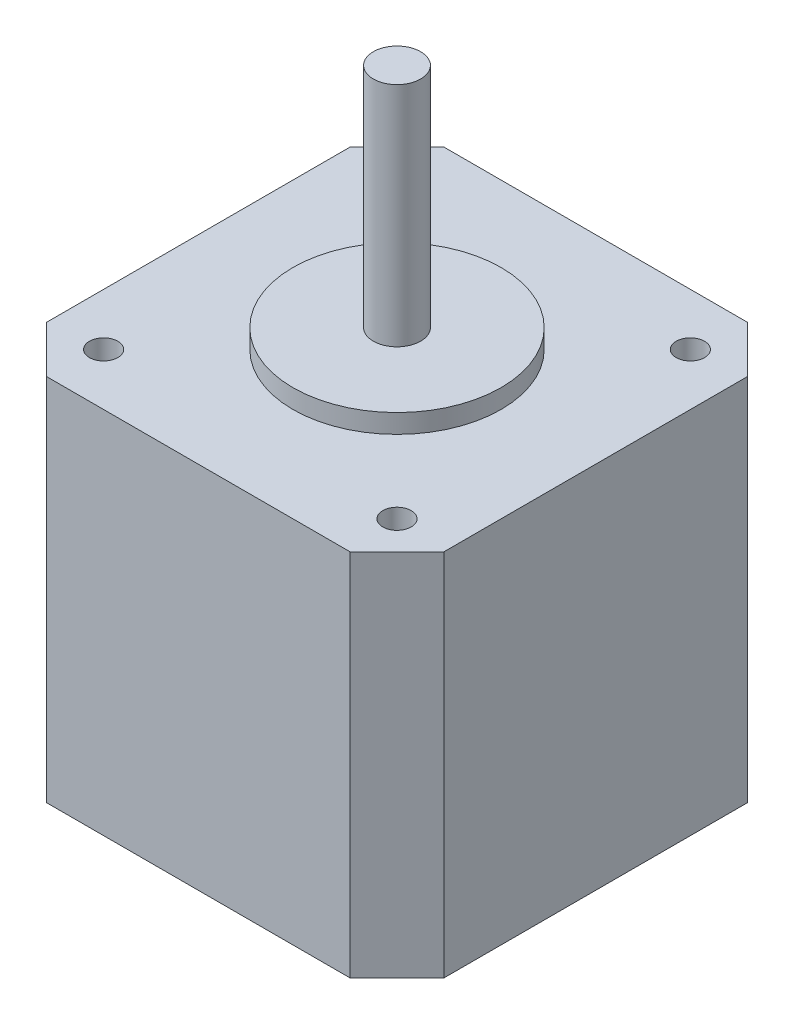
ISO-10303-21;
HEADER;
FILE_DESCRIPTION(('STEP AP214'),'2;1');
FILE_NAME('part.step','',(''),(''),'','','');
FILE_SCHEMA(('AUTOMOTIVE_DESIGN { 1 0 10303 214 1 1 1 1 }'));
ENDSEC;
DATA;
#1=APPLICATION_CONTEXT('core data for automotive mechanical design processes');
#2=APPLICATION_PROTOCOL_DEFINITION('international standard','automotive_design',2000,#1);
#3=PRODUCT_CONTEXT('',#1,'mechanical');
#4=PRODUCT('Part','Part','',(#3));
#5=PRODUCT_RELATED_PRODUCT_CATEGORY('part','',(#4));
#6=PRODUCT_DEFINITION_FORMATION('','',#4);
#7=PRODUCT_DEFINITION_CONTEXT('part definition',#1,'design');
#8=PRODUCT_DEFINITION('design','',#6,#7);
#9=PRODUCT_DEFINITION_SHAPE('','',#8);
#10=(LENGTH_UNIT() NAMED_UNIT(*) SI_UNIT(.MILLI.,.METRE.));
#11=(NAMED_UNIT(*) PLANE_ANGLE_UNIT() SI_UNIT($,.RADIAN.));
#12=(NAMED_UNIT(*) SI_UNIT($,.STERADIAN.) SOLID_ANGLE_UNIT());
#13=UNCERTAINTY_MEASURE_WITH_UNIT(LENGTH_MEASURE(1.E-05),#10,'distance_accuracy_value','');
#14=(GEOMETRIC_REPRESENTATION_CONTEXT(3) GLOBAL_UNCERTAINTY_ASSIGNED_CONTEXT((#13)) GLOBAL_UNIT_ASSIGNED_CONTEXT((#10,
#11,#12)) REPRESENTATION_CONTEXT('',''));
#15=CARTESIAN_POINT('',(0.,0.,0.));
#16=DIRECTION('',(0.,0.,1.));
#17=DIRECTION('',(1.,0.,0.));
#18=AXIS2_PLACEMENT_3D('',#15,#16,#17);
#19=CARTESIAN_POINT('',(0.,39.,0.));
#20=DIRECTION('',(1.,0.,0.));
#21=DIRECTION('',(0.,0.,-1.));
#22=AXIS2_PLACEMENT_3D('',#19,#20,#21);
#23=PLANE('',#22);
#24=DIRECTION('',(0.,0.,1.));
#25=VECTOR('',#24,1.);
#26=CARTESIAN_POINT('',(0.,39.,0.));
#27=LINE('',#26,#25);
#28=CARTESIAN_POINT('',(0.,39.,-37.0502525316942));
#29=VERTEX_POINT('',#28);
#30=CARTESIAN_POINT('',(0.,39.,-4.94974746830583));
#31=VERTEX_POINT('',#30);
#32=EDGE_CURVE('E121',#29,#31,#27,.T.);
#33=ORIENTED_EDGE('',*,*,#32,.F.);
#34=DIRECTION('',(0.,1.,0.));
#35=VECTOR('',#34,1.);
#36=CARTESIAN_POINT('',(0.,0.,-37.0502525316942));
#37=LINE('',#36,#35);
#38=CARTESIAN_POINT('',(0.,0.,-37.0502525316942));
#39=VERTEX_POINT('',#38);
#40=EDGE_CURVE('E178',#39,#29,#37,.T.);
#41=ORIENTED_EDGE('',*,*,#40,.F.);
#42=DIRECTION('',(0.,0.,1.));
#43=VECTOR('',#42,1.);
#44=CARTESIAN_POINT('',(0.,0.,0.));
#45=LINE('',#44,#43);
#46=CARTESIAN_POINT('',(0.,0.,-4.94974746830583));
#47=VERTEX_POINT('',#46);
#48=EDGE_CURVE('E122',#39,#47,#45,.T.);
#49=ORIENTED_EDGE('',*,*,#48,.T.);
#50=DIRECTION('',(0.,1.,0.));
#51=VECTOR('',#50,1.);
#52=CARTESIAN_POINT('',(0.,0.,-4.94974746830583));
#53=LINE('',#52,#51);
#54=EDGE_CURVE('E166',#47,#31,#53,.T.);
#55=ORIENTED_EDGE('',*,*,#54,.T.);
#56=EDGE_LOOP('',(#33,#41,#49,#55));
#57=FACE_BOUND('',#56,.T.);
#58=ADVANCED_FACE('F33',(#57),#23,.F.);
#59=CARTESIAN_POINT('',(0.,39.,0.));
#60=DIRECTION('',(0.,0.,-1.));
#61=DIRECTION('',(-1.,0.,0.));
#62=AXIS2_PLACEMENT_3D('',#59,#60,#61);
#63=PLANE('',#62);
#64=DIRECTION('',(1.,0.,0.));
#65=VECTOR('',#64,1.);
#66=CARTESIAN_POINT('',(0.,0.,0.));
#67=LINE('',#66,#65);
#68=CARTESIAN_POINT('',(4.94974746830583,0.,0.));
#69=VERTEX_POINT('',#68);
#70=CARTESIAN_POINT('',(37.0502525316942,0.,0.));
#71=VERTEX_POINT('',#70);
#72=EDGE_CURVE('E119',#69,#71,#67,.T.);
#73=ORIENTED_EDGE('',*,*,#72,.T.);
#74=DIRECTION('',(0.,1.,0.));
#75=VECTOR('',#74,1.);
#76=CARTESIAN_POINT('',(37.0502525316942,0.,0.));
#77=LINE('',#76,#75);
#78=CARTESIAN_POINT('',(37.0502525316942,39.,0.));
#79=VERTEX_POINT('',#78);
#80=EDGE_CURVE('E49',#71,#79,#77,.T.);
#81=ORIENTED_EDGE('',*,*,#80,.T.);
#82=DIRECTION('',(1.,0.,0.));
#83=VECTOR('',#82,1.);
#84=CARTESIAN_POINT('',(0.,39.,0.));
#85=LINE('',#84,#83);
#86=CARTESIAN_POINT('',(4.94974746830583,39.,0.));
#87=VERTEX_POINT('',#86);
#88=EDGE_CURVE('E132',#87,#79,#85,.T.);
#89=ORIENTED_EDGE('',*,*,#88,.F.);
#90=DIRECTION('',(0.,1.,0.));
#91=VECTOR('',#90,1.);
#92=CARTESIAN_POINT('',(4.94974746830583,0.,0.));
#93=LINE('',#92,#91);
#94=EDGE_CURVE('E169',#69,#87,#93,.T.);
#95=ORIENTED_EDGE('',*,*,#94,.F.);
#96=EDGE_LOOP('',(#73,#81,#89,#95));
#97=FACE_BOUND('',#96,.T.);
#98=ADVANCED_FACE('F197',(#97),#63,.F.);
#99=CARTESIAN_POINT('',(42.,39.,0.));
#100=DIRECTION('',(-1.,0.,0.));
#101=DIRECTION('',(0.,0.,1.));
#102=AXIS2_PLACEMENT_3D('',#99,#100,#101);
#103=PLANE('',#102);
#104=DIRECTION('',(0.,0.,-1.));
#105=VECTOR('',#104,1.);
#106=CARTESIAN_POINT('',(42.,0.,0.));
#107=LINE('',#106,#105);
#108=CARTESIAN_POINT('',(42.,0.,-4.94974746830583));
#109=VERTEX_POINT('',#108);
#110=CARTESIAN_POINT('',(42.,0.,-37.0502525316942));
#111=VERTEX_POINT('',#110);
#112=EDGE_CURVE('E111',#109,#111,#107,.T.);
#113=ORIENTED_EDGE('',*,*,#112,.T.);
#114=DIRECTION('',(0.,1.,0.));
#115=VECTOR('',#114,1.);
#116=CARTESIAN_POINT('',(42.,0.,-37.0502525316942));
#117=LINE('',#116,#115);
#118=CARTESIAN_POINT('',(42.,39.,-37.0502525316942));
#119=VERTEX_POINT('',#118);
#120=EDGE_CURVE('E57',#111,#119,#117,.T.);
#121=ORIENTED_EDGE('',*,*,#120,.T.);
#122=DIRECTION('',(0.,0.,-1.));
#123=VECTOR('',#122,1.);
#124=CARTESIAN_POINT('',(42.,39.,0.));
#125=LINE('',#124,#123);
#126=CARTESIAN_POINT('',(42.,39.,-4.94974746830583));
#127=VERTEX_POINT('',#126);
#128=EDGE_CURVE('E113',#127,#119,#125,.T.);
#129=ORIENTED_EDGE('',*,*,#128,.F.);
#130=DIRECTION('',(0.,1.,0.));
#131=VECTOR('',#130,1.);
#132=CARTESIAN_POINT('',(42.,0.,-4.94974746830583));
#133=LINE('',#132,#131);
#134=EDGE_CURVE('E99',#109,#127,#133,.T.);
#135=ORIENTED_EDGE('',*,*,#134,.F.);
#136=EDGE_LOOP('',(#113,#121,#129,#135));
#137=FACE_BOUND('',#136,.T.);
#138=ADVANCED_FACE('F110',(#137),#103,.F.);
#139=CARTESIAN_POINT('',(0.,39.,-42.));
#140=DIRECTION('',(0.,0.,1.));
#141=DIRECTION('',(1.,0.,0.));
#142=AXIS2_PLACEMENT_3D('',#139,#140,#141);
#143=PLANE('',#142);
#144=DIRECTION('',(-1.,0.,0.));
#145=VECTOR('',#144,1.);
#146=CARTESIAN_POINT('',(0.,0.,-42.));
#147=LINE('',#146,#145);
#148=CARTESIAN_POINT('',(37.0502525316942,0.,-42.));
#149=VERTEX_POINT('',#148);
#150=CARTESIAN_POINT('',(4.94974746830582,0.,-42.));
#151=VERTEX_POINT('',#150);
#152=EDGE_CURVE('E36',#149,#151,#147,.T.);
#153=ORIENTED_EDGE('',*,*,#152,.T.);
#154=DIRECTION('',(0.,1.,0.));
#155=VECTOR('',#154,1.);
#156=CARTESIAN_POINT('',(4.94974746830583,0.,-42.));
#157=LINE('',#156,#155);
#158=CARTESIAN_POINT('',(4.94974746830583,39.,-42.));
#159=VERTEX_POINT('',#158);
#160=EDGE_CURVE('E180',#151,#159,#157,.T.);
#161=ORIENTED_EDGE('',*,*,#160,.T.);
#162=DIRECTION('',(-1.,0.,0.));
#163=VECTOR('',#162,1.);
#164=CARTESIAN_POINT('',(0.,39.,-42.));
#165=LINE('',#164,#163);
#166=CARTESIAN_POINT('',(37.0502525316942,39.,-42.));
#167=VERTEX_POINT('',#166);
#168=EDGE_CURVE('E128',#167,#159,#165,.T.);
#169=ORIENTED_EDGE('',*,*,#168,.F.);
#170=DIRECTION('',(0.,1.,0.));
#171=VECTOR('',#170,1.);
#172=CARTESIAN_POINT('',(37.0502525316942,0.,-42.));
#173=LINE('',#172,#171);
#174=EDGE_CURVE('E188',#149,#167,#173,.T.);
#175=ORIENTED_EDGE('',*,*,#174,.F.);
#176=EDGE_LOOP('',(#153,#161,#169,#175));
#177=FACE_BOUND('',#176,.T.);
#178=ADVANCED_FACE('F211',(#177),#143,.F.);
#179=CARTESIAN_POINT('',(0.,39.,0.));
#180=DIRECTION('',(0.,-1.,0.));
#181=DIRECTION('',(0.,0.,-1.));
#182=AXIS2_PLACEMENT_3D('',#179,#180,#181);
#183=PLANE('',#182);
#184=CARTESIAN_POINT('',(36.5,39.,-36.5));
#185=DIRECTION('',(0.,1.,0.));
#186=DIRECTION('',(0.,0.,-1.));
#187=AXIS2_PLACEMENT_3D('',#184,#185,#186);
#188=CIRCLE('',#187,1.5);
#189=CARTESIAN_POINT('',(36.5,39.,-38.));
#190=VERTEX_POINT('',#189);
#191=EDGE_CURVE('E158',#190,#190,#188,.T.);
#192=ORIENTED_EDGE('',*,*,#191,.F.);
#193=EDGE_LOOP('',(#192));
#194=FACE_BOUND('',#193,.T.);
#195=CARTESIAN_POINT('',(5.49999999999998,39.,-5.50000000000004));
#196=DIRECTION('',(0.,1.,0.));
#197=DIRECTION('',(0.,0.,-1.));
#198=AXIS2_PLACEMENT_3D('',#195,#196,#197);
#199=CIRCLE('',#198,1.5);
#200=CARTESIAN_POINT('',(5.49999999999998,39.,-7.00000000000005));
#201=VERTEX_POINT('',#200);
#202=EDGE_CURVE('E151',#201,#201,#199,.T.);
#203=ORIENTED_EDGE('',*,*,#202,.F.);
#204=EDGE_LOOP('',(#203));
#205=FACE_BOUND('',#204,.T.);
#206=CARTESIAN_POINT('',(5.49999999999999,39.,-36.5));
#207=DIRECTION('',(0.,1.,0.));
#208=DIRECTION('',(0.,0.,1.));
#209=AXIS2_PLACEMENT_3D('',#206,#207,#208);
#210=CIRCLE('',#209,1.50000000000001);
#211=CARTESIAN_POINT('',(5.49999999999999,39.,-35.));
#212=VERTEX_POINT('',#211);
#213=EDGE_CURVE('E163',#212,#212,#210,.T.);
#214=ORIENTED_EDGE('',*,*,#213,.F.);
#215=EDGE_LOOP('',(#214));
#216=FACE_BOUND('',#215,.T.);
#217=CARTESIAN_POINT('',(36.5,39.,-5.5));
#218=DIRECTION('',(0.,1.,0.));
#219=DIRECTION('',(0.,0.,1.));
#220=AXIS2_PLACEMENT_3D('',#217,#218,#219);
#221=CIRCLE('',#220,1.5);
#222=CARTESIAN_POINT('',(36.5,39.,-4.));
#223=VERTEX_POINT('',#222);
#224=EDGE_CURVE('E145',#223,#223,#221,.T.);
#225=ORIENTED_EDGE('',*,*,#224,.F.);
#226=EDGE_LOOP('',(#225));
#227=FACE_BOUND('',#226,.T.);
#228=CARTESIAN_POINT('',(21.,39.,-21.));
#229=DIRECTION('',(0.,1.,0.));
#230=DIRECTION('',(0.,0.,1.));
#231=AXIS2_PLACEMENT_3D('',#228,#229,#230);
#232=CIRCLE('',#231,11.);
#233=CARTESIAN_POINT('',(21.,39.,-10.));
#234=VERTEX_POINT('',#233);
#235=EDGE_CURVE('E41',#234,#234,#232,.T.);
#236=ORIENTED_EDGE('',*,*,#235,.F.);
#237=EDGE_LOOP('',(#236));
#238=FACE_BOUND('',#237,.T.);
#239=ORIENTED_EDGE('',*,*,#168,.T.);
#240=DIRECTION('',(0.707106781186548,0.,-0.707106781186547));
#241=VECTOR('',#240,1.);
#242=CARTESIAN_POINT('',(0.,39.,-37.0502525316942));
#243=LINE('',#242,#241);
#244=EDGE_CURVE('E185',#29,#159,#243,.T.);
#245=ORIENTED_EDGE('',*,*,#244,.F.);
#246=ORIENTED_EDGE('',*,*,#32,.T.);
#247=DIRECTION('',(-0.707106781186548,0.,-0.707106781186548));
#248=VECTOR('',#247,1.);
#249=CARTESIAN_POINT('',(0.,39.,-4.94974746830583));
#250=LINE('',#249,#248);
#251=EDGE_CURVE('E174',#87,#31,#250,.T.);
#252=ORIENTED_EDGE('',*,*,#251,.F.);
#253=ORIENTED_EDGE('',*,*,#88,.T.);
#254=DIRECTION('',(-0.707106781186547,0.,0.707106781186548));
#255=VECTOR('',#254,1.);
#256=CARTESIAN_POINT('',(37.0502525316942,39.,0.));
#257=LINE('',#256,#255);
#258=EDGE_CURVE('E105',#127,#79,#257,.T.);
#259=ORIENTED_EDGE('',*,*,#258,.F.);
#260=ORIENTED_EDGE('',*,*,#128,.T.);
#261=DIRECTION('',(0.707106781186547,0.,0.707106781186547));
#262=VECTOR('',#261,1.);
#263=CARTESIAN_POINT('',(37.0502525316942,39.,-42.));
#264=LINE('',#263,#262);
#265=EDGE_CURVE('E184',#167,#119,#264,.T.);
#266=ORIENTED_EDGE('',*,*,#265,.F.);
#267=EDGE_LOOP('',(#239,#245,#246,#252,#253,#259,#260,#266));
#268=FACE_BOUND('',#267,.T.);
#269=ADVANCED_FACE('F200',(#194,#205,#216,#227,#238,#268),#183,.F.);
#270=CARTESIAN_POINT('',(0.,0.,0.));
#271=DIRECTION('',(0.,-1.,0.));
#272=DIRECTION('',(0.,0.,-1.));
#273=AXIS2_PLACEMENT_3D('',#270,#271,#272);
#274=PLANE('',#273);
#275=DIRECTION('',(0.707106781186548,0.,-0.707106781186547));
#276=VECTOR('',#275,1.);
#277=CARTESIAN_POINT('',(0.,0.,-37.0502525316942));
#278=LINE('',#277,#276);
#279=EDGE_CURVE('E181',#39,#151,#278,.T.);
#280=ORIENTED_EDGE('',*,*,#279,.T.);
#281=ORIENTED_EDGE('',*,*,#152,.F.);
#282=DIRECTION('',(0.707106781186547,0.,0.707106781186547));
#283=VECTOR('',#282,1.);
#284=CARTESIAN_POINT('',(37.0502525316942,0.,-42.));
#285=LINE('',#284,#283);
#286=EDGE_CURVE('E118',#149,#111,#285,.T.);
#287=ORIENTED_EDGE('',*,*,#286,.T.);
#288=ORIENTED_EDGE('',*,*,#112,.F.);
#289=DIRECTION('',(-0.707106781186547,0.,0.707106781186548));
#290=VECTOR('',#289,1.);
#291=CARTESIAN_POINT('',(37.0502525316942,0.,0.));
#292=LINE('',#291,#290);
#293=EDGE_CURVE('E96',#109,#71,#292,.T.);
#294=ORIENTED_EDGE('',*,*,#293,.T.);
#295=ORIENTED_EDGE('',*,*,#72,.F.);
#296=DIRECTION('',(-0.707106781186548,0.,-0.707106781186548));
#297=VECTOR('',#296,1.);
#298=CARTESIAN_POINT('',(0.,0.,-4.94974746830583));
#299=LINE('',#298,#297);
#300=EDGE_CURVE('E171',#69,#47,#299,.T.);
#301=ORIENTED_EDGE('',*,*,#300,.T.);
#302=ORIENTED_EDGE('',*,*,#48,.F.);
#303=EDGE_LOOP('',(#280,#281,#287,#288,#294,#295,#301,#302));
#304=FACE_BOUND('',#303,.T.);
#305=ADVANCED_FACE('F116',(#304),#274,.T.);
#306=CARTESIAN_POINT('',(21.,41.,-21.));
#307=DIRECTION('',(0.,-1.,0.));
#308=DIRECTION('',(0.,0.,-1.));
#309=AXIS2_PLACEMENT_3D('',#306,#307,#308);
#310=CYLINDRICAL_SURFACE('',#309,11.);
#311=CARTESIAN_POINT('',(21.,41.,-21.));
#312=DIRECTION('',(0.,1.,0.));
#313=DIRECTION('',(0.,0.,1.));
#314=AXIS2_PLACEMENT_3D('',#311,#312,#313);
#315=CIRCLE('',#314,11.);
#316=CARTESIAN_POINT('',(21.,41.,-10.));
#317=VERTEX_POINT('',#316);
#318=EDGE_CURVE('E127',#317,#317,#315,.T.);
#319=ORIENTED_EDGE('',*,*,#318,.F.);
#320=EDGE_LOOP('',(#319));
#321=FACE_BOUND('',#320,.T.);
#322=ORIENTED_EDGE('',*,*,#235,.T.);
#323=EDGE_LOOP('',(#322));
#324=FACE_BOUND('',#323,.T.);
#325=ADVANCED_FACE('F236',(#321,#324),#310,.T.);
#326=CARTESIAN_POINT('',(21.,41.,-21.));
#327=DIRECTION('',(0.,1.,0.));
#328=DIRECTION('',(0.,0.,1.));
#329=AXIS2_PLACEMENT_3D('',#326,#327,#328);
#330=PLANE('',#329);
#331=CARTESIAN_POINT('',(21.,41.,-21.));
#332=DIRECTION('',(0.,1.,0.));
#333=DIRECTION('',(0.,0.,1.));
#334=AXIS2_PLACEMENT_3D('',#331,#332,#333);
#335=CIRCLE('',#334,2.5);
#336=CARTESIAN_POINT('',(21.,41.,-18.5));
#337=VERTEX_POINT('',#336);
#338=EDGE_CURVE('E11',#337,#337,#335,.T.);
#339=ORIENTED_EDGE('',*,*,#338,.F.);
#340=EDGE_LOOP('',(#339));
#341=FACE_BOUND('',#340,.T.);
#342=ORIENTED_EDGE('',*,*,#318,.T.);
#343=EDGE_LOOP('',(#342));
#344=FACE_BOUND('',#343,.T.);
#345=ADVANCED_FACE('F242',(#341,#344),#330,.T.);
#346=CARTESIAN_POINT('',(21.,65.,-21.));
#347=DIRECTION('',(0.,-1.,0.));
#348=DIRECTION('',(0.,0.,-1.));
#349=AXIS2_PLACEMENT_3D('',#346,#347,#348);
#350=CYLINDRICAL_SURFACE('',#349,2.5);
#351=CARTESIAN_POINT('',(21.,65.,-21.));
#352=DIRECTION('',(0.,1.,0.));
#353=DIRECTION('',(0.,0.,1.));
#354=AXIS2_PLACEMENT_3D('',#351,#352,#353);
#355=CIRCLE('',#354,2.5);
#356=CARTESIAN_POINT('',(21.,65.,-18.5));
#357=VERTEX_POINT('',#356);
#358=EDGE_CURVE('E140',#357,#357,#355,.T.);
#359=ORIENTED_EDGE('',*,*,#358,.F.);
#360=EDGE_LOOP('',(#359));
#361=FACE_BOUND('',#360,.T.);
#362=ORIENTED_EDGE('',*,*,#338,.T.);
#363=EDGE_LOOP('',(#362));
#364=FACE_BOUND('',#363,.T.);
#365=ADVANCED_FACE('F246',(#361,#364),#350,.T.);
#366=CARTESIAN_POINT('',(21.,65.,-21.));
#367=DIRECTION('',(0.,1.,0.));
#368=DIRECTION('',(0.,0.,1.));
#369=AXIS2_PLACEMENT_3D('',#366,#367,#368);
#370=PLANE('',#369);
#371=ORIENTED_EDGE('',*,*,#358,.T.);
#372=EDGE_LOOP('',(#371));
#373=FACE_BOUND('',#372,.T.);
#374=ADVANCED_FACE('F250',(#373),#370,.T.);
#375=CARTESIAN_POINT('',(36.5,34.5,-5.5));
#376=DIRECTION('',(0.,1.,0.));
#377=DIRECTION('',(0.,0.,1.));
#378=AXIS2_PLACEMENT_3D('',#375,#376,#377);
#379=CYLINDRICAL_SURFACE('',#378,1.5);
#380=CARTESIAN_POINT('',(36.5,34.5,-5.5));
#381=DIRECTION('',(0.,1.,0.));
#382=DIRECTION('',(0.,0.,1.));
#383=AXIS2_PLACEMENT_3D('',#380,#381,#382);
#384=CIRCLE('',#383,1.5);
#385=CARTESIAN_POINT('',(36.5,34.5,-4.));
#386=VERTEX_POINT('',#385);
#387=EDGE_CURVE('E144',#386,#386,#384,.T.);
#388=ORIENTED_EDGE('',*,*,#387,.F.);
#389=EDGE_LOOP('',(#388));
#390=FACE_BOUND('',#389,.T.);
#391=ORIENTED_EDGE('',*,*,#224,.T.);
#392=EDGE_LOOP('',(#391));
#393=FACE_BOUND('',#392,.T.);
#394=ADVANCED_FACE('F254',(#390,#393),#379,.F.);
#395=CARTESIAN_POINT('',(36.5,34.5,-5.5));
#396=DIRECTION('',(0.,1.,0.));
#397=DIRECTION('',(0.,0.,1.));
#398=AXIS2_PLACEMENT_3D('',#395,#396,#397);
#399=PLANE('',#398);
#400=ORIENTED_EDGE('',*,*,#387,.T.);
#401=EDGE_LOOP('',(#400));
#402=FACE_BOUND('',#401,.T.);
#403=ADVANCED_FACE('F258',(#402),#399,.T.);
#404=CARTESIAN_POINT('',(5.49999999999999,34.5,-36.5));
#405=DIRECTION('',(0.,1.,0.));
#406=DIRECTION('',(0.,0.,1.));
#407=AXIS2_PLACEMENT_3D('',#404,#405,#406);
#408=CYLINDRICAL_SURFACE('',#407,1.50000000000001);
#409=CARTESIAN_POINT('',(5.49999999999999,34.5,-36.5));
#410=DIRECTION('',(0.,1.,0.));
#411=DIRECTION('',(0.,0.,1.));
#412=AXIS2_PLACEMENT_3D('',#409,#410,#411);
#413=CIRCLE('',#412,1.50000000000001);
#414=CARTESIAN_POINT('',(5.49999999999999,34.5,-35.));
#415=VERTEX_POINT('',#414);
#416=EDGE_CURVE('E155',#415,#415,#413,.T.);
#417=ORIENTED_EDGE('',*,*,#416,.F.);
#418=EDGE_LOOP('',(#417));
#419=FACE_BOUND('',#418,.T.);
#420=ORIENTED_EDGE('',*,*,#213,.T.);
#421=EDGE_LOOP('',(#420));
#422=FACE_BOUND('',#421,.T.);
#423=ADVANCED_FACE('F262',(#419,#422),#408,.F.);
#424=CARTESIAN_POINT('',(5.49999999999999,34.5,-36.5));
#425=DIRECTION('',(0.,1.,0.));
#426=DIRECTION('',(0.,0.,1.));
#427=AXIS2_PLACEMENT_3D('',#424,#425,#426);
#428=PLANE('',#427);
#429=ORIENTED_EDGE('',*,*,#416,.T.);
#430=EDGE_LOOP('',(#429));
#431=FACE_BOUND('',#430,.T.);
#432=ADVANCED_FACE('F268',(#431),#428,.T.);
#433=CARTESIAN_POINT('',(5.49999999999998,34.5,-5.50000000000004));
#434=DIRECTION('',(0.,1.,0.));
#435=DIRECTION('',(0.,0.,1.));
#436=AXIS2_PLACEMENT_3D('',#433,#434,#435);
#437=CYLINDRICAL_SURFACE('',#436,1.5);
#438=CARTESIAN_POINT('',(5.49999999999998,34.5,-5.50000000000004));
#439=DIRECTION('',(0.,1.,0.));
#440=DIRECTION('',(0.,0.,-1.));
#441=AXIS2_PLACEMENT_3D('',#438,#439,#440);
#442=CIRCLE('',#441,1.5);
#443=CARTESIAN_POINT('',(5.49999999999998,34.5,-7.00000000000005));
#444=VERTEX_POINT('',#443);
#445=EDGE_CURVE('E154',#444,#444,#442,.T.);
#446=ORIENTED_EDGE('',*,*,#445,.F.);
#447=EDGE_LOOP('',(#446));
#448=FACE_BOUND('',#447,.T.);
#449=ORIENTED_EDGE('',*,*,#202,.T.);
#450=EDGE_LOOP('',(#449));
#451=FACE_BOUND('',#450,.T.);
#452=ADVANCED_FACE('F264',(#448,#451),#437,.F.);
#453=CARTESIAN_POINT('',(5.49999999999998,34.5,-5.50000000000004));
#454=DIRECTION('',(0.,-1.,0.));
#455=DIRECTION('',(0.,0.,-1.));
#456=AXIS2_PLACEMENT_3D('',#453,#454,#455);
#457=PLANE('',#456);
#458=ORIENTED_EDGE('',*,*,#445,.T.);
#459=EDGE_LOOP('',(#458));
#460=FACE_BOUND('',#459,.T.);
#461=ADVANCED_FACE('F267',(#460),#457,.F.);
#462=CARTESIAN_POINT('',(36.5,34.5,-36.5));
#463=DIRECTION('',(0.,1.,0.));
#464=DIRECTION('',(0.,0.,1.));
#465=AXIS2_PLACEMENT_3D('',#462,#463,#464);
#466=CYLINDRICAL_SURFACE('',#465,1.5);
#467=CARTESIAN_POINT('',(36.5,34.5,-36.5));
#468=DIRECTION('',(0.,1.,0.));
#469=DIRECTION('',(0.,0.,-1.));
#470=AXIS2_PLACEMENT_3D('',#467,#468,#469);
#471=CIRCLE('',#470,1.5);
#472=CARTESIAN_POINT('',(36.5,34.5,-38.));
#473=VERTEX_POINT('',#472);
#474=EDGE_CURVE('E148',#473,#473,#471,.T.);
#475=ORIENTED_EDGE('',*,*,#474,.F.);
#476=EDGE_LOOP('',(#475));
#477=FACE_BOUND('',#476,.T.);
#478=ORIENTED_EDGE('',*,*,#191,.T.);
#479=EDGE_LOOP('',(#478));
#480=FACE_BOUND('',#479,.T.);
#481=ADVANCED_FACE('F272',(#477,#480),#466,.F.);
#482=CARTESIAN_POINT('',(36.5,34.5,-36.5));
#483=DIRECTION('',(0.,-1.,0.));
#484=DIRECTION('',(0.,0.,-1.));
#485=AXIS2_PLACEMENT_3D('',#482,#483,#484);
#486=PLANE('',#485);
#487=ORIENTED_EDGE('',*,*,#474,.T.);
#488=EDGE_LOOP('',(#487));
#489=FACE_BOUND('',#488,.T.);
#490=ADVANCED_FACE('F276',(#489),#486,.F.);
#491=CARTESIAN_POINT('',(0.,0.,-4.94974746830583));
#492=DIRECTION('',(0.707106781186548,0.,-0.707106781186548));
#493=DIRECTION('',(-0.707106781186548,0.,-0.707106781186548));
#494=AXIS2_PLACEMENT_3D('',#491,#492,#493);
#495=PLANE('',#494);
#496=ORIENTED_EDGE('',*,*,#251,.T.);
#497=ORIENTED_EDGE('',*,*,#54,.F.);
#498=ORIENTED_EDGE('',*,*,#300,.F.);
#499=ORIENTED_EDGE('',*,*,#94,.T.);
#500=EDGE_LOOP('',(#496,#497,#498,#499));
#501=FACE_BOUND('',#500,.T.);
#502=ADVANCED_FACE('F204',(#501),#495,.F.);
#503=CARTESIAN_POINT('',(37.0502525316942,0.,0.));
#504=DIRECTION('',(-0.707106781186548,0.,-0.707106781186547));
#505=DIRECTION('',(-0.707106781186547,0.,0.707106781186548));
#506=AXIS2_PLACEMENT_3D('',#503,#504,#505);
#507=PLANE('',#506);
#508=ORIENTED_EDGE('',*,*,#258,.T.);
#509=ORIENTED_EDGE('',*,*,#80,.F.);
#510=ORIENTED_EDGE('',*,*,#293,.F.);
#511=ORIENTED_EDGE('',*,*,#134,.T.);
#512=EDGE_LOOP('',(#508,#509,#510,#511));
#513=FACE_BOUND('',#512,.T.);
#514=ADVANCED_FACE('F98',(#513),#507,.F.);
#515=CARTESIAN_POINT('',(37.0502525316942,0.,-42.));
#516=DIRECTION('',(-0.707106781186548,0.,0.707106781186548));
#517=DIRECTION('',(0.707106781186548,0.,0.707106781186548));
#518=AXIS2_PLACEMENT_3D('',#515,#516,#517);
#519=PLANE('',#518);
#520=ORIENTED_EDGE('',*,*,#265,.T.);
#521=ORIENTED_EDGE('',*,*,#120,.F.);
#522=ORIENTED_EDGE('',*,*,#286,.F.);
#523=ORIENTED_EDGE('',*,*,#174,.T.);
#524=EDGE_LOOP('',(#520,#521,#522,#523));
#525=FACE_BOUND('',#524,.T.);
#526=ADVANCED_FACE('F214',(#525),#519,.F.);
#527=CARTESIAN_POINT('',(0.,0.,-37.0502525316942));
#528=DIRECTION('',(0.707106781186547,0.,0.707106781186548));
#529=DIRECTION('',(0.707106781186548,0.,-0.707106781186547));
#530=AXIS2_PLACEMENT_3D('',#527,#528,#529);
#531=PLANE('',#530);
#532=ORIENTED_EDGE('',*,*,#244,.T.);
#533=ORIENTED_EDGE('',*,*,#160,.F.);
#534=ORIENTED_EDGE('',*,*,#279,.F.);
#535=ORIENTED_EDGE('',*,*,#40,.T.);
#536=EDGE_LOOP('',(#532,#533,#534,#535));
#537=FACE_BOUND('',#536,.T.);
#538=ADVANCED_FACE('F215',(#537),#531,.F.);
#539=CLOSED_SHELL('',(#58,#98,#138,#178,#269,#305,#325,#345,#365,#374,#394,#403,#423,#432,#452,
#461,#481,#490,#502,#514,#526,#538));
#540=MANIFOLD_SOLID_BREP('B2',#539);
#541=ADVANCED_BREP_SHAPE_REPRESENTATION('',(#18,#540),#14);
#542=SHAPE_DEFINITION_REPRESENTATION(#9,#541);
ENDSEC;
END-ISO-10303-21;
